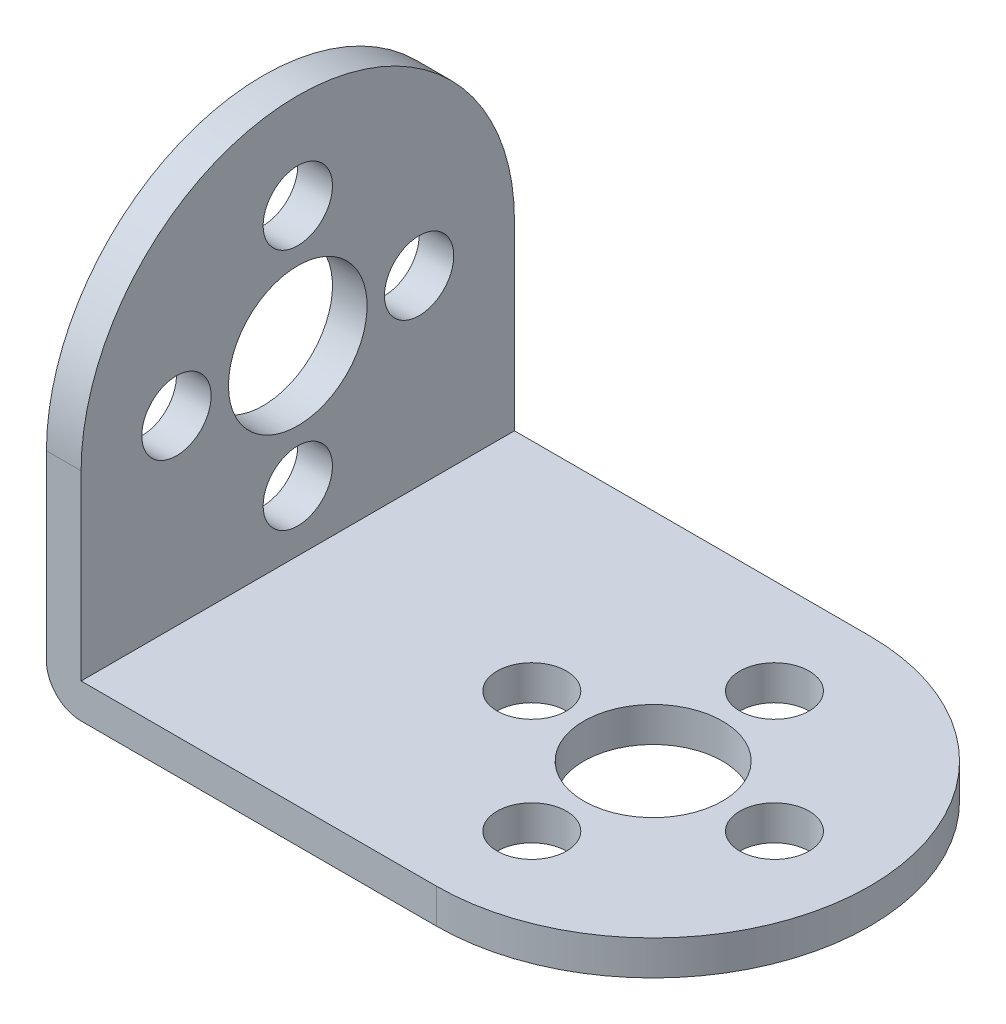
ISO-10303-21;
HEADER;
FILE_DESCRIPTION(('STEP AP214'),'2;1');
FILE_NAME('part.step','',(''),(''),'','','');
FILE_SCHEMA(('AUTOMOTIVE_DESIGN { 1 0 10303 214 1 1 1 1 }'));
ENDSEC;
DATA;
#1=APPLICATION_CONTEXT('core data for automotive mechanical design processes');
#2=APPLICATION_PROTOCOL_DEFINITION('international standard','automotive_design',2000,#1);
#3=PRODUCT_CONTEXT('',#1,'mechanical');
#4=PRODUCT('Part','Part','',(#3));
#5=PRODUCT_RELATED_PRODUCT_CATEGORY('part','',(#4));
#6=PRODUCT_DEFINITION_FORMATION('','',#4);
#7=PRODUCT_DEFINITION_CONTEXT('part definition',#1,'design');
#8=PRODUCT_DEFINITION('design','',#6,#7);
#9=PRODUCT_DEFINITION_SHAPE('','',#8);
#10=(LENGTH_UNIT() NAMED_UNIT(*) SI_UNIT(.MILLI.,.METRE.));
#11=(NAMED_UNIT(*) PLANE_ANGLE_UNIT() SI_UNIT($,.RADIAN.));
#12=(NAMED_UNIT(*) SI_UNIT($,.STERADIAN.) SOLID_ANGLE_UNIT());
#13=UNCERTAINTY_MEASURE_WITH_UNIT(LENGTH_MEASURE(1.E-05),#10,'distance_accuracy_value','');
#14=(GEOMETRIC_REPRESENTATION_CONTEXT(3) GLOBAL_UNCERTAINTY_ASSIGNED_CONTEXT((#13)) GLOBAL_UNIT_ASSIGNED_CONTEXT((#10,
#11,#12)) REPRESENTATION_CONTEXT('',''));
#15=CARTESIAN_POINT('',(0.,0.,0.));
#16=DIRECTION('',(0.,0.,1.));
#17=DIRECTION('',(1.,0.,0.));
#18=AXIS2_PLACEMENT_3D('',#15,#16,#17);
#19=CARTESIAN_POINT('',(-9.25,2.,-12.5));
#20=DIRECTION('',(0.,0.,1.));
#21=DIRECTION('',(1.,0.,0.));
#22=AXIS2_PLACEMENT_3D('',#19,#20,#21);
#23=CYLINDRICAL_SURFACE('',#22,2.);
#24=DIRECTION('',(0.,0.,1.));
#25=VECTOR('',#24,1.);
#26=CARTESIAN_POINT('',(-11.25,2.,-12.5));
#27=LINE('',#26,#25);
#28=CARTESIAN_POINT('',(-11.25,2.,-12.5));
#29=VERTEX_POINT('',#28);
#30=CARTESIAN_POINT('',(-11.25,2.,12.5));
#31=VERTEX_POINT('',#30);
#32=EDGE_CURVE('E181',#29,#31,#27,.T.);
#33=ORIENTED_EDGE('',*,*,#32,.F.);
#34=CARTESIAN_POINT('',(-9.25,2.,-12.5));
#35=DIRECTION('',(0.,0.,1.));
#36=DIRECTION('',(1.,0.,0.));
#37=AXIS2_PLACEMENT_3D('',#34,#35,#36);
#38=CIRCLE('',#37,2.);
#39=CARTESIAN_POINT('',(-9.25,0.,-12.5));
#40=VERTEX_POINT('',#39);
#41=EDGE_CURVE('E45',#40,#29,#38,.F.);
#42=ORIENTED_EDGE('',*,*,#41,.F.);
#43=DIRECTION('',(0.,0.,1.));
#44=VECTOR('',#43,1.);
#45=CARTESIAN_POINT('',(-9.25,0.,0.));
#46=LINE('',#45,#44);
#47=CARTESIAN_POINT('',(-9.25,0.,12.5));
#48=VERTEX_POINT('',#47);
#49=EDGE_CURVE('E184',#48,#40,#46,.F.);
#50=ORIENTED_EDGE('',*,*,#49,.F.);
#51=CARTESIAN_POINT('',(-9.25,2.,12.5));
#52=DIRECTION('',(0.,0.,-1.));
#53=DIRECTION('',(-1.,0.,0.));
#54=AXIS2_PLACEMENT_3D('',#51,#52,#53);
#55=CIRCLE('',#54,2.);
#56=EDGE_CURVE('E11',#31,#48,#55,.F.);
#57=ORIENTED_EDGE('',*,*,#56,.F.);
#58=EDGE_LOOP('',(#33,#42,#50,#57));
#59=FACE_BOUND('',#58,.T.);
#60=ADVANCED_FACE('F38',(#59),#23,.T.);
#61=CARTESIAN_POINT('',(11.25,2.,0.));
#62=DIRECTION('',(0.,1.,0.));
#63=DIRECTION('',(0.,0.,1.));
#64=AXIS2_PLACEMENT_3D('',#61,#62,#63);
#65=PLANE('',#64);
#66=CARTESIAN_POINT('',(4.25,2.,0.));
#67=DIRECTION('',(0.,1.,0.));
#68=DIRECTION('',(0.,0.,1.));
#69=AXIS2_PLACEMENT_3D('',#66,#67,#68);
#70=CIRCLE('',#69,2.);
#71=CARTESIAN_POINT('',(4.25,2.,1.99999999999995));
#72=VERTEX_POINT('',#71);
#73=EDGE_CURVE('E133',#72,#72,#70,.T.);
#74=ORIENTED_EDGE('',*,*,#73,.F.);
#75=EDGE_LOOP('',(#74));
#76=FACE_BOUND('',#75,.T.);
#77=CARTESIAN_POINT('',(18.25,2.,0.));
#78=DIRECTION('',(0.,1.,0.));
#79=DIRECTION('',(0.,0.,1.));
#80=AXIS2_PLACEMENT_3D('',#77,#78,#79);
#81=CIRCLE('',#80,2.);
#82=CARTESIAN_POINT('',(18.25,2.,2.));
#83=VERTEX_POINT('',#82);
#84=EDGE_CURVE('E145',#83,#83,#81,.T.);
#85=ORIENTED_EDGE('',*,*,#84,.F.);
#86=EDGE_LOOP('',(#85));
#87=FACE_BOUND('',#86,.T.);
#88=CARTESIAN_POINT('',(11.25,2.,0.));
#89=DIRECTION('',(0.,1.,0.));
#90=DIRECTION('',(0.,0.,1.));
#91=AXIS2_PLACEMENT_3D('',#88,#89,#90);
#92=CIRCLE('',#91,4.);
#93=CARTESIAN_POINT('',(11.25,2.,4.));
#94=VERTEX_POINT('',#93);
#95=EDGE_CURVE('E151',#94,#94,#92,.T.);
#96=ORIENTED_EDGE('',*,*,#95,.F.);
#97=EDGE_LOOP('',(#96));
#98=FACE_BOUND('',#97,.T.);
#99=CARTESIAN_POINT('',(11.25,2.,7.));
#100=DIRECTION('',(0.,1.,0.));
#101=DIRECTION('',(0.,0.,1.));
#102=AXIS2_PLACEMENT_3D('',#99,#100,#101);
#103=CIRCLE('',#102,2.);
#104=CARTESIAN_POINT('',(11.25,2.,9.));
#105=VERTEX_POINT('',#104);
#106=EDGE_CURVE('E139',#105,#105,#103,.T.);
#107=ORIENTED_EDGE('',*,*,#106,.F.);
#108=EDGE_LOOP('',(#107));
#109=FACE_BOUND('',#108,.T.);
#110=CARTESIAN_POINT('',(11.2500000000001,2.,-7.));
#111=DIRECTION('',(0.,1.,0.));
#112=DIRECTION('',(0.,0.,1.));
#113=AXIS2_PLACEMENT_3D('',#110,#111,#112);
#114=CIRCLE('',#113,2.);
#115=CARTESIAN_POINT('',(11.2500000000001,2.,-5.));
#116=VERTEX_POINT('',#115);
#117=EDGE_CURVE('E127',#116,#116,#114,.T.);
#118=ORIENTED_EDGE('',*,*,#117,.F.);
#119=EDGE_LOOP('',(#118));
#120=FACE_BOUND('',#119,.T.);
#121=DIRECTION('',(-1.,0.,0.));
#122=VECTOR('',#121,1.);
#123=CARTESIAN_POINT('',(-11.25,2.,-12.5));
#124=LINE('',#123,#122);
#125=CARTESIAN_POINT('',(11.25,2.,-12.5));
#126=VERTEX_POINT('',#125);
#127=CARTESIAN_POINT('',(-9.25,2.,-12.5));
#128=VERTEX_POINT('',#127);
#129=EDGE_CURVE('E160',#126,#128,#124,.T.);
#130=ORIENTED_EDGE('',*,*,#129,.T.);
#131=DIRECTION('',(0.,0.,1.));
#132=VECTOR('',#131,1.);
#133=CARTESIAN_POINT('',(-9.25,2.,0.));
#134=LINE('',#133,#132);
#135=CARTESIAN_POINT('',(-9.25,2.,12.5));
#136=VERTEX_POINT('',#135);
#137=EDGE_CURVE('E123',#128,#136,#134,.T.);
#138=ORIENTED_EDGE('',*,*,#137,.T.);
#139=DIRECTION('',(1.,0.,0.));
#140=VECTOR('',#139,1.);
#141=CARTESIAN_POINT('',(-11.25,2.,12.5));
#142=LINE('',#141,#140);
#143=CARTESIAN_POINT('',(11.25,2.,12.5));
#144=VERTEX_POINT('',#143);
#145=EDGE_CURVE('E99',#136,#144,#142,.T.);
#146=ORIENTED_EDGE('',*,*,#145,.T.);
#147=CARTESIAN_POINT('',(11.25,2.,0.));
#148=DIRECTION('',(0.,1.,0.));
#149=DIRECTION('',(0.,0.,1.));
#150=AXIS2_PLACEMENT_3D('',#147,#148,#149);
#151=CIRCLE('',#150,12.5);
#152=EDGE_CURVE('E157',#144,#126,#151,.T.);
#153=ORIENTED_EDGE('',*,*,#152,.T.);
#154=EDGE_LOOP('',(#130,#138,#146,#153));
#155=FACE_BOUND('',#154,.T.);
#156=ADVANCED_FACE('F222',(#76,#87,#98,#109,#120,#155),#65,.T.);
#157=CARTESIAN_POINT('',(11.25,0.,0.));
#158=DIRECTION('',(0.,1.,0.));
#159=DIRECTION('',(0.,0.,1.));
#160=AXIS2_PLACEMENT_3D('',#157,#158,#159);
#161=PLANE('',#160);
#162=DIRECTION('',(1.,0.,0.));
#163=VECTOR('',#162,1.);
#164=CARTESIAN_POINT('',(-11.25,0.,12.5));
#165=LINE('',#164,#163);
#166=CARTESIAN_POINT('',(11.25,0.,12.5));
#167=VERTEX_POINT('',#166);
#168=EDGE_CURVE('E161',#48,#167,#165,.T.);
#169=ORIENTED_EDGE('',*,*,#168,.F.);
#170=ORIENTED_EDGE('',*,*,#49,.T.);
#171=DIRECTION('',(-1.,0.,0.));
#172=VECTOR('',#171,1.);
#173=CARTESIAN_POINT('',(-11.25,0.,-12.5));
#174=LINE('',#173,#172);
#175=CARTESIAN_POINT('',(11.25,0.,-12.5));
#176=VERTEX_POINT('',#175);
#177=EDGE_CURVE('E167',#176,#40,#174,.T.);
#178=ORIENTED_EDGE('',*,*,#177,.F.);
#179=CARTESIAN_POINT('',(11.25,0.,0.));
#180=DIRECTION('',(0.,1.,0.));
#181=DIRECTION('',(0.,0.,1.));
#182=AXIS2_PLACEMENT_3D('',#179,#180,#181);
#183=CIRCLE('',#182,12.5);
#184=EDGE_CURVE('E154',#167,#176,#183,.T.);
#185=ORIENTED_EDGE('',*,*,#184,.F.);
#186=EDGE_LOOP('',(#169,#170,#178,#185));
#187=FACE_BOUND('',#186,.T.);
#188=CARTESIAN_POINT('',(11.2500000000001,0.,-7.));
#189=DIRECTION('',(0.,1.,0.));
#190=DIRECTION('',(0.,0.,1.));
#191=AXIS2_PLACEMENT_3D('',#188,#189,#190);
#192=CIRCLE('',#191,2.);
#193=CARTESIAN_POINT('',(11.2500000000001,0.,-5.));
#194=VERTEX_POINT('',#193);
#195=EDGE_CURVE('E126',#194,#194,#192,.T.);
#196=ORIENTED_EDGE('',*,*,#195,.T.);
#197=EDGE_LOOP('',(#196));
#198=FACE_BOUND('',#197,.T.);
#199=CARTESIAN_POINT('',(4.25,0.,0.));
#200=DIRECTION('',(0.,1.,0.));
#201=DIRECTION('',(0.,0.,1.));
#202=AXIS2_PLACEMENT_3D('',#199,#200,#201);
#203=CIRCLE('',#202,2.);
#204=CARTESIAN_POINT('',(4.25,0.,1.99999999999995));
#205=VERTEX_POINT('',#204);
#206=EDGE_CURVE('E130',#205,#205,#203,.T.);
#207=ORIENTED_EDGE('',*,*,#206,.T.);
#208=EDGE_LOOP('',(#207));
#209=FACE_BOUND('',#208,.T.);
#210=CARTESIAN_POINT('',(11.25,0.,7.));
#211=DIRECTION('',(0.,1.,0.));
#212=DIRECTION('',(0.,0.,1.));
#213=AXIS2_PLACEMENT_3D('',#210,#211,#212);
#214=CIRCLE('',#213,2.);
#215=CARTESIAN_POINT('',(11.25,0.,9.));
#216=VERTEX_POINT('',#215);
#217=EDGE_CURVE('E136',#216,#216,#214,.T.);
#218=ORIENTED_EDGE('',*,*,#217,.T.);
#219=EDGE_LOOP('',(#218));
#220=FACE_BOUND('',#219,.T.);
#221=CARTESIAN_POINT('',(18.25,0.,0.));
#222=DIRECTION('',(0.,1.,0.));
#223=DIRECTION('',(0.,0.,1.));
#224=AXIS2_PLACEMENT_3D('',#221,#222,#223);
#225=CIRCLE('',#224,2.);
#226=CARTESIAN_POINT('',(18.25,0.,2.));
#227=VERTEX_POINT('',#226);
#228=EDGE_CURVE('E142',#227,#227,#225,.T.);
#229=ORIENTED_EDGE('',*,*,#228,.T.);
#230=EDGE_LOOP('',(#229));
#231=FACE_BOUND('',#230,.T.);
#232=CARTESIAN_POINT('',(11.25,0.,0.));
#233=DIRECTION('',(0.,1.,0.));
#234=DIRECTION('',(0.,0.,1.));
#235=AXIS2_PLACEMENT_3D('',#232,#233,#234);
#236=CIRCLE('',#235,4.);
#237=CARTESIAN_POINT('',(11.25,0.,4.));
#238=VERTEX_POINT('',#237);
#239=EDGE_CURVE('E148',#238,#238,#236,.T.);
#240=ORIENTED_EDGE('',*,*,#239,.T.);
#241=EDGE_LOOP('',(#240));
#242=FACE_BOUND('',#241,.T.);
#243=ADVANCED_FACE('F228',(#187,#198,#209,#220,#231,#242),#161,.F.);
#244=CARTESIAN_POINT('',(11.25,2.,0.));
#245=DIRECTION('',(0.,-1.,0.));
#246=DIRECTION('',(0.,0.,-1.));
#247=AXIS2_PLACEMENT_3D('',#244,#245,#246);
#248=CYLINDRICAL_SURFACE('',#247,12.5);
#249=ORIENTED_EDGE('',*,*,#184,.T.);
#250=DIRECTION('',(0.,-1.,0.));
#251=VECTOR('',#250,1.);
#252=CARTESIAN_POINT('',(11.25,2.,-12.5));
#253=LINE('',#252,#251);
#254=EDGE_CURVE('E178',#126,#176,#253,.T.);
#255=ORIENTED_EDGE('',*,*,#254,.F.);
#256=ORIENTED_EDGE('',*,*,#152,.F.);
#257=DIRECTION('',(0.,-1.,0.));
#258=VECTOR('',#257,1.);
#259=CARTESIAN_POINT('',(11.25,2.,12.5));
#260=LINE('',#259,#258);
#261=EDGE_CURVE('E164',#144,#167,#260,.T.);
#262=ORIENTED_EDGE('',*,*,#261,.T.);
#263=EDGE_LOOP('',(#249,#255,#256,#262));
#264=FACE_BOUND('',#263,.T.);
#265=ADVANCED_FACE('F224',(#264),#248,.T.);
#266=CARTESIAN_POINT('',(-11.25,2.,-12.5));
#267=DIRECTION('',(0.,0.,1.));
#268=DIRECTION('',(1.,0.,0.));
#269=AXIS2_PLACEMENT_3D('',#266,#267,#268);
#270=PLANE('',#269);
#271=ORIENTED_EDGE('',*,*,#177,.T.);
#272=ORIENTED_EDGE('',*,*,#41,.T.);
#273=DIRECTION('',(0.,-1.,0.));
#274=VECTOR('',#273,1.);
#275=CARTESIAN_POINT('',(-11.25,2.,-12.5));
#276=LINE('',#275,#274);
#277=CARTESIAN_POINT('',(-11.25,12.5,-12.5));
#278=VERTEX_POINT('',#277);
#279=EDGE_CURVE('E175',#278,#29,#276,.T.);
#280=ORIENTED_EDGE('',*,*,#279,.F.);
#281=DIRECTION('',(-1.,0.,0.));
#282=VECTOR('',#281,1.);
#283=CARTESIAN_POINT('',(-9.25,12.5,-12.5));
#284=LINE('',#283,#282);
#285=CARTESIAN_POINT('',(-9.25,12.5,-12.5));
#286=VERTEX_POINT('',#285);
#287=EDGE_CURVE('E112',#286,#278,#284,.T.);
#288=ORIENTED_EDGE('',*,*,#287,.F.);
#289=DIRECTION('',(0.,-1.,0.));
#290=VECTOR('',#289,1.);
#291=CARTESIAN_POINT('',(-9.25,0.,-12.5));
#292=LINE('',#291,#290);
#293=EDGE_CURVE('E104',#286,#128,#292,.T.);
#294=ORIENTED_EDGE('',*,*,#293,.T.);
#295=ORIENTED_EDGE('',*,*,#129,.F.);
#296=ORIENTED_EDGE('',*,*,#254,.T.);
#297=EDGE_LOOP('',(#271,#272,#280,#288,#294,#295,#296));
#298=FACE_BOUND('',#297,.T.);
#299=ADVANCED_FACE('F186',(#298),#270,.F.);
#300=CARTESIAN_POINT('',(-11.25,2.,-12.5));
#301=DIRECTION('',(1.,0.,0.));
#302=DIRECTION('',(0.,0.,-1.));
#303=AXIS2_PLACEMENT_3D('',#300,#301,#302);
#304=PLANE('',#303);
#305=ORIENTED_EDGE('',*,*,#279,.T.);
#306=ORIENTED_EDGE('',*,*,#32,.T.);
#307=DIRECTION('',(0.,-1.,0.));
#308=VECTOR('',#307,1.);
#309=CARTESIAN_POINT('',(-11.25,2.,12.5));
#310=LINE('',#309,#308);
#311=CARTESIAN_POINT('',(-11.25,12.5,12.5));
#312=VERTEX_POINT('',#311);
#313=EDGE_CURVE('E173',#312,#31,#310,.T.);
#314=ORIENTED_EDGE('',*,*,#313,.F.);
#315=CARTESIAN_POINT('',(-11.25,12.5,0.));
#316=DIRECTION('',(-1.,0.,0.));
#317=DIRECTION('',(0.,0.,1.));
#318=AXIS2_PLACEMENT_3D('',#315,#316,#317);
#319=CIRCLE('',#318,12.5);
#320=EDGE_CURVE('E111',#312,#278,#319,.T.);
#321=ORIENTED_EDGE('',*,*,#320,.T.);
#322=EDGE_LOOP('',(#305,#306,#314,#321));
#323=FACE_BOUND('',#322,.T.);
#324=CARTESIAN_POINT('',(-11.25,12.5,-6.99999999999991));
#325=DIRECTION('',(-1.,0.,0.));
#326=DIRECTION('',(0.,0.,1.));
#327=AXIS2_PLACEMENT_3D('',#324,#325,#326);
#328=CIRCLE('',#327,2.);
#329=CARTESIAN_POINT('',(-11.25,12.5,-4.99999999999991));
#330=VERTEX_POINT('',#329);
#331=EDGE_CURVE('E195',#330,#330,#328,.T.);
#332=ORIENTED_EDGE('',*,*,#331,.F.);
#333=EDGE_LOOP('',(#332));
#334=FACE_BOUND('',#333,.T.);
#335=CARTESIAN_POINT('',(-11.25,5.49999999999999,1.46642216231412E-13));
#336=DIRECTION('',(-1.,0.,0.));
#337=DIRECTION('',(0.,0.,1.));
#338=AXIS2_PLACEMENT_3D('',#335,#336,#337);
#339=CIRCLE('',#338,2.);
#340=CARTESIAN_POINT('',(-11.25,5.49999999999999,2.00000000000015));
#341=VERTEX_POINT('',#340);
#342=EDGE_CURVE('E199',#341,#341,#339,.T.);
#343=ORIENTED_EDGE('',*,*,#342,.F.);
#344=EDGE_LOOP('',(#343));
#345=FACE_BOUND('',#344,.T.);
#346=CARTESIAN_POINT('',(-11.25,12.5000000000001,7.0000000000001));
#347=DIRECTION('',(-1.,0.,0.));
#348=DIRECTION('',(0.,0.,1.));
#349=AXIS2_PLACEMENT_3D('',#346,#347,#348);
#350=CIRCLE('',#349,2.);
#351=CARTESIAN_POINT('',(-11.25,12.5000000000001,9.0000000000001));
#352=VERTEX_POINT('',#351);
#353=EDGE_CURVE('E203',#352,#352,#350,.T.);
#354=ORIENTED_EDGE('',*,*,#353,.F.);
#355=EDGE_LOOP('',(#354));
#356=FACE_BOUND('',#355,.T.);
#357=CARTESIAN_POINT('',(-11.25,19.5,0.));
#358=DIRECTION('',(-1.,0.,0.));
#359=DIRECTION('',(0.,0.,1.));
#360=AXIS2_PLACEMENT_3D('',#357,#358,#359);
#361=CIRCLE('',#360,2.);
#362=CARTESIAN_POINT('',(-11.25,19.5,2.));
#363=VERTEX_POINT('',#362);
#364=EDGE_CURVE('E207',#363,#363,#361,.T.);
#365=ORIENTED_EDGE('',*,*,#364,.F.);
#366=EDGE_LOOP('',(#365));
#367=FACE_BOUND('',#366,.T.);
#368=CARTESIAN_POINT('',(-11.25,12.5,0.));
#369=DIRECTION('',(-1.,0.,0.));
#370=DIRECTION('',(0.,0.,1.));
#371=AXIS2_PLACEMENT_3D('',#368,#369,#370);
#372=CIRCLE('',#371,4.);
#373=CARTESIAN_POINT('',(-11.25,12.5,4.));
#374=VERTEX_POINT('',#373);
#375=EDGE_CURVE('E210',#374,#374,#372,.T.);
#376=ORIENTED_EDGE('',*,*,#375,.F.);
#377=EDGE_LOOP('',(#376));
#378=FACE_BOUND('',#377,.T.);
#379=ADVANCED_FACE('F188',(#323,#334,#345,#356,#367,#378),#304,.F.);
#380=CARTESIAN_POINT('',(-11.25,2.,12.5));
#381=DIRECTION('',(0.,0.,-1.));
#382=DIRECTION('',(-1.,0.,0.));
#383=AXIS2_PLACEMENT_3D('',#380,#381,#382);
#384=PLANE('',#383);
#385=ORIENTED_EDGE('',*,*,#313,.T.);
#386=ORIENTED_EDGE('',*,*,#56,.T.);
#387=ORIENTED_EDGE('',*,*,#168,.T.);
#388=ORIENTED_EDGE('',*,*,#261,.F.);
#389=ORIENTED_EDGE('',*,*,#145,.F.);
#390=DIRECTION('',(0.,1.,0.));
#391=VECTOR('',#390,1.);
#392=CARTESIAN_POINT('',(-9.25,0.,12.5));
#393=LINE('',#392,#391);
#394=CARTESIAN_POINT('',(-9.25,12.5,12.5));
#395=VERTEX_POINT('',#394);
#396=EDGE_CURVE('E93',#136,#395,#393,.T.);
#397=ORIENTED_EDGE('',*,*,#396,.T.);
#398=DIRECTION('',(-1.,0.,0.));
#399=VECTOR('',#398,1.);
#400=CARTESIAN_POINT('',(-9.25,12.5,12.5));
#401=LINE('',#400,#399);
#402=EDGE_CURVE('E96',#395,#312,#401,.T.);
#403=ORIENTED_EDGE('',*,*,#402,.T.);
#404=EDGE_LOOP('',(#385,#386,#387,#388,#389,#397,#403));
#405=FACE_BOUND('',#404,.T.);
#406=ADVANCED_FACE('F95',(#405),#384,.F.);
#407=CARTESIAN_POINT('',(11.25,2.,0.));
#408=DIRECTION('',(0.,-1.,0.));
#409=DIRECTION('',(0.,0.,-1.));
#410=AXIS2_PLACEMENT_3D('',#407,#408,#409);
#411=CYLINDRICAL_SURFACE('',#410,4.);
#412=ORIENTED_EDGE('',*,*,#95,.T.);
#413=EDGE_LOOP('',(#412));
#414=FACE_BOUND('',#413,.T.);
#415=ORIENTED_EDGE('',*,*,#239,.F.);
#416=EDGE_LOOP('',(#415));
#417=FACE_BOUND('',#416,.T.);
#418=ADVANCED_FACE('F242',(#414,#417),#411,.F.);
#419=CARTESIAN_POINT('',(18.25,2.,0.));
#420=DIRECTION('',(0.,-1.,0.));
#421=DIRECTION('',(0.,0.,-1.));
#422=AXIS2_PLACEMENT_3D('',#419,#420,#421);
#423=CYLINDRICAL_SURFACE('',#422,2.);
#424=ORIENTED_EDGE('',*,*,#84,.T.);
#425=EDGE_LOOP('',(#424));
#426=FACE_BOUND('',#425,.T.);
#427=ORIENTED_EDGE('',*,*,#228,.F.);
#428=EDGE_LOOP('',(#427));
#429=FACE_BOUND('',#428,.T.);
#430=ADVANCED_FACE('F244',(#426,#429),#423,.F.);
#431=CARTESIAN_POINT('',(11.25,2.,7.));
#432=DIRECTION('',(0.,-1.,0.));
#433=DIRECTION('',(0.,0.,-1.));
#434=AXIS2_PLACEMENT_3D('',#431,#432,#433);
#435=CYLINDRICAL_SURFACE('',#434,2.);
#436=ORIENTED_EDGE('',*,*,#106,.T.);
#437=EDGE_LOOP('',(#436));
#438=FACE_BOUND('',#437,.T.);
#439=ORIENTED_EDGE('',*,*,#217,.F.);
#440=EDGE_LOOP('',(#439));
#441=FACE_BOUND('',#440,.T.);
#442=ADVANCED_FACE('F251',(#438,#441),#435,.F.);
#443=CARTESIAN_POINT('',(4.25,2.,0.));
#444=DIRECTION('',(0.,-1.,0.));
#445=DIRECTION('',(0.,0.,-1.));
#446=AXIS2_PLACEMENT_3D('',#443,#444,#445);
#447=CYLINDRICAL_SURFACE('',#446,2.);
#448=ORIENTED_EDGE('',*,*,#73,.T.);
#449=EDGE_LOOP('',(#448));
#450=FACE_BOUND('',#449,.T.);
#451=ORIENTED_EDGE('',*,*,#206,.F.);
#452=EDGE_LOOP('',(#451));
#453=FACE_BOUND('',#452,.T.);
#454=ADVANCED_FACE('F382',(#450,#453),#447,.F.);
#455=CARTESIAN_POINT('',(11.2500000000001,2.,-7.));
#456=DIRECTION('',(0.,-1.,0.));
#457=DIRECTION('',(0.,0.,-1.));
#458=AXIS2_PLACEMENT_3D('',#455,#456,#457);
#459=CYLINDRICAL_SURFACE('',#458,2.);
#460=ORIENTED_EDGE('',*,*,#117,.T.);
#461=EDGE_LOOP('',(#460));
#462=FACE_BOUND('',#461,.T.);
#463=ORIENTED_EDGE('',*,*,#195,.F.);
#464=EDGE_LOOP('',(#463));
#465=FACE_BOUND('',#464,.T.);
#466=ADVANCED_FACE('F301',(#462,#465),#459,.F.);
#467=CARTESIAN_POINT('',(-9.25,12.5,0.));
#468=DIRECTION('',(-1.,0.,0.));
#469=DIRECTION('',(0.,0.,1.));
#470=AXIS2_PLACEMENT_3D('',#467,#468,#469);
#471=CYLINDRICAL_SURFACE('',#470,12.5);
#472=ORIENTED_EDGE('',*,*,#320,.F.);
#473=ORIENTED_EDGE('',*,*,#402,.F.);
#474=CARTESIAN_POINT('',(-9.25,12.5,0.));
#475=DIRECTION('',(-1.,0.,0.));
#476=DIRECTION('',(0.,0.,1.));
#477=AXIS2_PLACEMENT_3D('',#474,#475,#476);
#478=CIRCLE('',#477,12.5);
#479=EDGE_CURVE('E103',#395,#286,#478,.T.);
#480=ORIENTED_EDGE('',*,*,#479,.T.);
#481=ORIENTED_EDGE('',*,*,#287,.T.);
#482=EDGE_LOOP('',(#472,#473,#480,#481));
#483=FACE_BOUND('',#482,.T.);
#484=ADVANCED_FACE('F108',(#483),#471,.T.);
#485=CARTESIAN_POINT('',(-9.25,12.5,0.));
#486=DIRECTION('',(-1.,0.,0.));
#487=DIRECTION('',(0.,0.,1.));
#488=AXIS2_PLACEMENT_3D('',#485,#486,#487);
#489=PLANE('',#488);
#490=ORIENTED_EDGE('',*,*,#137,.F.);
#491=ORIENTED_EDGE('',*,*,#293,.F.);
#492=ORIENTED_EDGE('',*,*,#479,.F.);
#493=ORIENTED_EDGE('',*,*,#396,.F.);
#494=EDGE_LOOP('',(#490,#491,#492,#493));
#495=FACE_BOUND('',#494,.T.);
#496=CARTESIAN_POINT('',(-9.25,12.5,-6.99999999999991));
#497=DIRECTION('',(-1.,0.,0.));
#498=DIRECTION('',(0.,0.,1.));
#499=AXIS2_PLACEMENT_3D('',#496,#497,#498);
#500=CIRCLE('',#499,2.);
#501=CARTESIAN_POINT('',(-9.25,12.5,-4.99999999999991));
#502=VERTEX_POINT('',#501);
#503=EDGE_CURVE('E430',#502,#502,#500,.T.);
#504=ORIENTED_EDGE('',*,*,#503,.T.);
#505=EDGE_LOOP('',(#504));
#506=FACE_BOUND('',#505,.T.);
#507=CARTESIAN_POINT('',(-9.25,5.49999999999999,1.46642216231412E-13));
#508=DIRECTION('',(-1.,0.,0.));
#509=DIRECTION('',(0.,0.,1.));
#510=AXIS2_PLACEMENT_3D('',#507,#508,#509);
#511=CIRCLE('',#510,2.);
#512=CARTESIAN_POINT('',(-9.25,5.49999999999999,2.00000000000015));
#513=VERTEX_POINT('',#512);
#514=EDGE_CURVE('E434',#513,#513,#511,.T.);
#515=ORIENTED_EDGE('',*,*,#514,.T.);
#516=EDGE_LOOP('',(#515));
#517=FACE_BOUND('',#516,.T.);
#518=CARTESIAN_POINT('',(-9.25,12.5000000000001,7.0000000000001));
#519=DIRECTION('',(-1.,0.,0.));
#520=DIRECTION('',(0.,0.,1.));
#521=AXIS2_PLACEMENT_3D('',#518,#519,#520);
#522=CIRCLE('',#521,2.);
#523=CARTESIAN_POINT('',(-9.25,12.5000000000001,9.0000000000001));
#524=VERTEX_POINT('',#523);
#525=EDGE_CURVE('E438',#524,#524,#522,.T.);
#526=ORIENTED_EDGE('',*,*,#525,.T.);
#527=EDGE_LOOP('',(#526));
#528=FACE_BOUND('',#527,.T.);
#529=CARTESIAN_POINT('',(-9.25,19.5,0.));
#530=DIRECTION('',(-1.,0.,0.));
#531=DIRECTION('',(0.,0.,1.));
#532=AXIS2_PLACEMENT_3D('',#529,#530,#531);
#533=CIRCLE('',#532,2.);
#534=CARTESIAN_POINT('',(-9.25,19.5,2.));
#535=VERTEX_POINT('',#534);
#536=EDGE_CURVE('E212',#535,#535,#533,.T.);
#537=ORIENTED_EDGE('',*,*,#536,.T.);
#538=EDGE_LOOP('',(#537));
#539=FACE_BOUND('',#538,.T.);
#540=CARTESIAN_POINT('',(-9.25,12.5,0.));
#541=DIRECTION('',(-1.,0.,0.));
#542=DIRECTION('',(0.,0.,1.));
#543=AXIS2_PLACEMENT_3D('',#540,#541,#542);
#544=CIRCLE('',#543,4.);
#545=CARTESIAN_POINT('',(-9.25,12.5,4.));
#546=VERTEX_POINT('',#545);
#547=EDGE_CURVE('E122',#546,#546,#544,.T.);
#548=ORIENTED_EDGE('',*,*,#547,.T.);
#549=EDGE_LOOP('',(#548));
#550=FACE_BOUND('',#549,.T.);
#551=ADVANCED_FACE('F115',(#495,#506,#517,#528,#539,#550),#489,.F.);
#552=CARTESIAN_POINT('',(-9.25,12.5,0.));
#553=DIRECTION('',(-1.,0.,0.));
#554=DIRECTION('',(0.,0.,1.));
#555=AXIS2_PLACEMENT_3D('',#552,#553,#554);
#556=CYLINDRICAL_SURFACE('',#555,4.);
#557=ORIENTED_EDGE('',*,*,#547,.F.);
#558=EDGE_LOOP('',(#557));
#559=FACE_BOUND('',#558,.T.);
#560=ORIENTED_EDGE('',*,*,#375,.T.);
#561=EDGE_LOOP('',(#560));
#562=FACE_BOUND('',#561,.T.);
#563=ADVANCED_FACE('F309',(#559,#562),#556,.F.);
#564=CARTESIAN_POINT('',(-9.25,19.5,0.));
#565=DIRECTION('',(-1.,0.,0.));
#566=DIRECTION('',(0.,0.,1.));
#567=AXIS2_PLACEMENT_3D('',#564,#565,#566);
#568=CYLINDRICAL_SURFACE('',#567,2.);
#569=ORIENTED_EDGE('',*,*,#536,.F.);
#570=EDGE_LOOP('',(#569));
#571=FACE_BOUND('',#570,.T.);
#572=ORIENTED_EDGE('',*,*,#364,.T.);
#573=EDGE_LOOP('',(#572));
#574=FACE_BOUND('',#573,.T.);
#575=ADVANCED_FACE('F317',(#571,#574),#568,.F.);
#576=CARTESIAN_POINT('',(-9.25,12.5000000000001,7.0000000000001));
#577=DIRECTION('',(-1.,0.,0.));
#578=DIRECTION('',(0.,0.,1.));
#579=AXIS2_PLACEMENT_3D('',#576,#577,#578);
#580=CYLINDRICAL_SURFACE('',#579,2.);
#581=ORIENTED_EDGE('',*,*,#525,.F.);
#582=EDGE_LOOP('',(#581));
#583=FACE_BOUND('',#582,.T.);
#584=ORIENTED_EDGE('',*,*,#353,.T.);
#585=EDGE_LOOP('',(#584));
#586=FACE_BOUND('',#585,.T.);
#587=ADVANCED_FACE('F326',(#583,#586),#580,.F.);
#588=CARTESIAN_POINT('',(-9.25,5.49999999999999,1.46642216231412E-13));
#589=DIRECTION('',(-1.,0.,0.));
#590=DIRECTION('',(0.,0.,1.));
#591=AXIS2_PLACEMENT_3D('',#588,#589,#590);
#592=CYLINDRICAL_SURFACE('',#591,2.);
#593=ORIENTED_EDGE('',*,*,#514,.F.);
#594=EDGE_LOOP('',(#593));
#595=FACE_BOUND('',#594,.T.);
#596=ORIENTED_EDGE('',*,*,#342,.T.);
#597=EDGE_LOOP('',(#596));
#598=FACE_BOUND('',#597,.T.);
#599=ADVANCED_FACE('F335',(#595,#598),#592,.F.);
#600=CARTESIAN_POINT('',(-9.25,12.5,-6.99999999999991));
#601=DIRECTION('',(-1.,0.,0.));
#602=DIRECTION('',(0.,0.,1.));
#603=AXIS2_PLACEMENT_3D('',#600,#601,#602);
#604=CYLINDRICAL_SURFACE('',#603,2.);
#605=ORIENTED_EDGE('',*,*,#503,.F.);
#606=EDGE_LOOP('',(#605));
#607=FACE_BOUND('',#606,.T.);
#608=ORIENTED_EDGE('',*,*,#331,.T.);
#609=EDGE_LOOP('',(#608));
#610=FACE_BOUND('',#609,.T.);
#611=ADVANCED_FACE('F344',(#607,#610),#604,.F.);
#612=CLOSED_SHELL('',(#60,#156,#243,#265,#299,#379,#406,#418,#430,#442,#454,#466,#484,#551,#563,
#575,#587,#599,#611));
#613=MANIFOLD_SOLID_BREP('B2',#612);
#614=ADVANCED_BREP_SHAPE_REPRESENTATION('',(#18,#613),#14);
#615=SHAPE_DEFINITION_REPRESENTATION(#9,#614);
ENDSEC;
END-ISO-10303-21;
